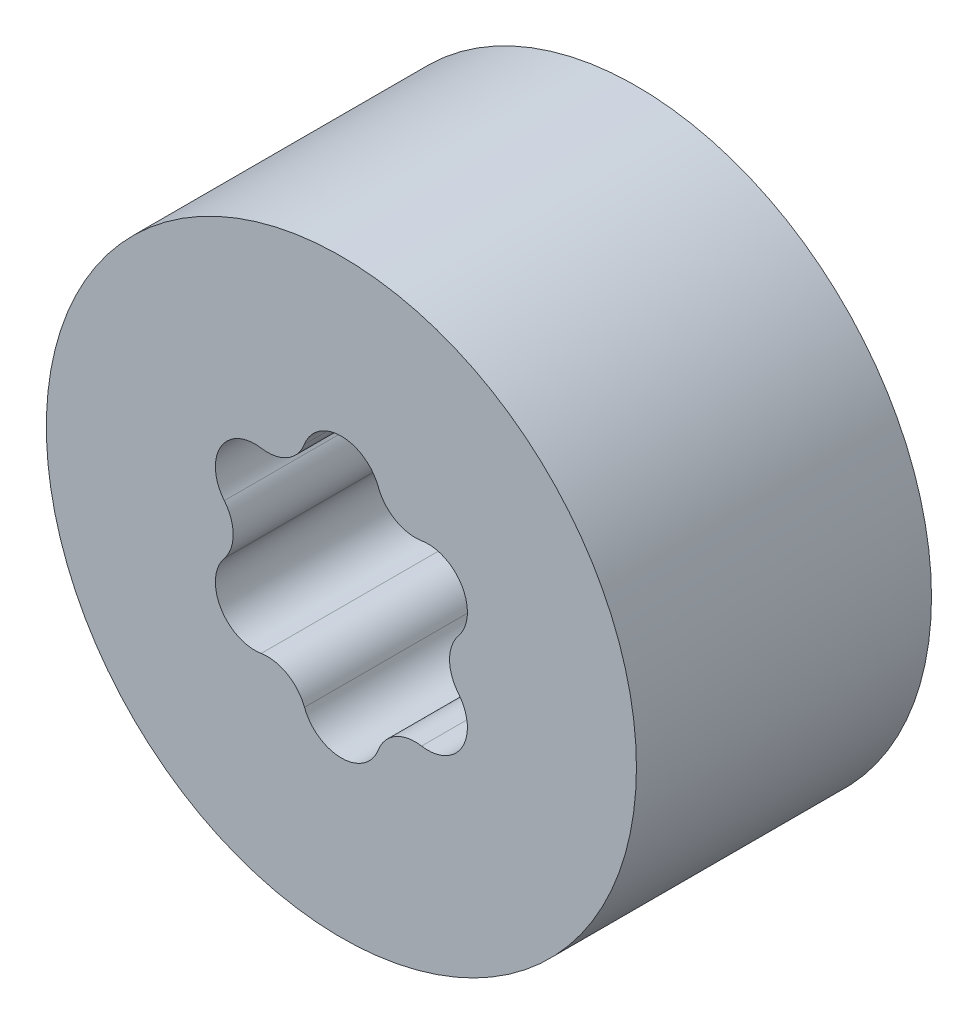
ISO-10303-21;
HEADER;
FILE_DESCRIPTION(('STEP AP214'),'2;1');
FILE_NAME('part.step','',(''),(''),'','','');
FILE_SCHEMA(('AUTOMOTIVE_DESIGN { 1 0 10303 214 1 1 1 1 }'));
ENDSEC;
DATA;
#1=APPLICATION_CONTEXT('core data for automotive mechanical design processes');
#2=APPLICATION_PROTOCOL_DEFINITION('international standard','automotive_design',2000,#1);
#3=PRODUCT_CONTEXT('',#1,'mechanical');
#4=PRODUCT('Part','Part','',(#3));
#5=PRODUCT_RELATED_PRODUCT_CATEGORY('part','',(#4));
#6=PRODUCT_DEFINITION_FORMATION('','',#4);
#7=PRODUCT_DEFINITION_CONTEXT('part definition',#1,'design');
#8=PRODUCT_DEFINITION('design','',#6,#7);
#9=PRODUCT_DEFINITION_SHAPE('','',#8);
#10=(LENGTH_UNIT() NAMED_UNIT(*) SI_UNIT(.MILLI.,.METRE.));
#11=(NAMED_UNIT(*) PLANE_ANGLE_UNIT() SI_UNIT($,.RADIAN.));
#12=(NAMED_UNIT(*) SI_UNIT($,.STERADIAN.) SOLID_ANGLE_UNIT());
#13=UNCERTAINTY_MEASURE_WITH_UNIT(LENGTH_MEASURE(1.E-05),#10,'distance_accuracy_value','');
#14=(GEOMETRIC_REPRESENTATION_CONTEXT(3) GLOBAL_UNCERTAINTY_ASSIGNED_CONTEXT((#13)) GLOBAL_UNIT_ASSIGNED_CONTEXT((#10,
#11,#12)) REPRESENTATION_CONTEXT('',''));
#15=CARTESIAN_POINT('',(0.,0.,0.));
#16=DIRECTION('',(0.,0.,1.));
#17=DIRECTION('',(1.,0.,0.));
#18=AXIS2_PLACEMENT_3D('',#15,#16,#17);
#19=CARTESIAN_POINT('',(0.,0.,9.525));
#20=DIRECTION('',(0.,0.,1.));
#21=DIRECTION('',(1.,0.,0.));
#22=AXIS2_PLACEMENT_3D('',#19,#20,#21);
#23=PLANE('',#22);
#24=CARTESIAN_POINT('',(0.,0.,9.525));
#25=DIRECTION('',(0.,0.,1.));
#26=DIRECTION('',(1.,0.,0.));
#27=AXIS2_PLACEMENT_3D('',#24,#25,#26);
#28=CIRCLE('',#27,19.05);
#29=CARTESIAN_POINT('',(19.05,0.,9.525));
#30=VERTEX_POINT('',#29);
#31=EDGE_CURVE('E11',#30,#30,#28,.T.);
#32=ORIENTED_EDGE('',*,*,#31,.T.);
#33=EDGE_LOOP('',(#32));
#34=FACE_BOUND('',#33,.T.);
#35=CARTESIAN_POINT('',(0.,-6.45235202820206,9.525));
#36=DIRECTION('',(0.,0.,-1.));
#37=DIRECTION('',(-1.,0.,0.));
#38=AXIS2_PLACEMENT_3D('',#35,#36,#37);
#39=CIRCLE('',#38,2.54764797179794);
#40=CARTESIAN_POINT('',(2.38293377059363,-7.35353837584087,9.525));
#41=VERTEX_POINT('',#40);
#42=CARTESIAN_POINT('',(-2.38293377059363,-7.35353837584087,9.525));
#43=VERTEX_POINT('',#42);
#44=EDGE_CURVE('E124',#41,#43,#39,.T.);
#45=ORIENTED_EDGE('',*,*,#44,.T.);
#46=CARTESIAN_POINT('',(-4.76586754118725,-8.25472472347968,9.525));
#47=DIRECTION('',(0.,0.,1.));
#48=DIRECTION('',(-1.,0.,0.));
#49=AXIS2_PLACEMENT_3D('',#46,#47,#48);
#50=CIRCLE('',#49,2.54764797179793);
#51=CARTESIAN_POINT('',(-5.17688415588514,-5.74045036879035,9.525));
#52=VERTEX_POINT('',#51);
#53=EDGE_CURVE('E133',#43,#52,#50,.T.);
#54=ORIENTED_EDGE('',*,*,#53,.T.);
#55=CARTESIAN_POINT('',(-5.58790077058303,-3.22617601410103,9.525));
#56=DIRECTION('',(0.,0.,-1.));
#57=DIRECTION('',(-1.,0.,0.));
#58=AXIS2_PLACEMENT_3D('',#55,#56,#57);
#59=CIRCLE('',#58,2.54764797179794);
#60=CARTESIAN_POINT('',(-7.55981792647877,-1.61308800705051,9.525));
#61=VERTEX_POINT('',#60);
#62=EDGE_CURVE('E48',#52,#61,#59,.T.);
#63=ORIENTED_EDGE('',*,*,#62,.T.);
#64=CARTESIAN_POINT('',(-9.53173508237451,0.,9.525));
#65=DIRECTION('',(0.,0.,1.));
#66=DIRECTION('',(-1.,0.,0.));
#67=AXIS2_PLACEMENT_3D('',#64,#65,#66);
#68=CIRCLE('',#67,2.54764797179794);
#69=CARTESIAN_POINT('',(-7.55981792647877,1.61308800705052,9.525));
#70=VERTEX_POINT('',#69);
#71=EDGE_CURVE('E146',#61,#70,#68,.T.);
#72=ORIENTED_EDGE('',*,*,#71,.T.);
#73=CARTESIAN_POINT('',(-5.58790077058303,3.22617601410103,9.525));
#74=DIRECTION('',(0.,0.,-1.));
#75=DIRECTION('',(-1.,0.,0.));
#76=AXIS2_PLACEMENT_3D('',#73,#74,#75);
#77=CIRCLE('',#76,2.54764797179794);
#78=CARTESIAN_POINT('',(-5.17688415588515,5.74045036879036,9.525));
#79=VERTEX_POINT('',#78);
#80=EDGE_CURVE('E149',#70,#79,#77,.T.);
#81=ORIENTED_EDGE('',*,*,#80,.T.);
#82=CARTESIAN_POINT('',(-4.76586754118726,8.25472472347969,9.525));
#83=DIRECTION('',(0.,0.,1.));
#84=DIRECTION('',(-1.,0.,0.));
#85=AXIS2_PLACEMENT_3D('',#82,#83,#84);
#86=CIRCLE('',#85,2.54764797179794);
#87=CARTESIAN_POINT('',(-2.38293377059363,7.35353837584088,9.525));
#88=VERTEX_POINT('',#87);
#89=EDGE_CURVE('E152',#79,#88,#86,.T.);
#90=ORIENTED_EDGE('',*,*,#89,.T.);
#91=CARTESIAN_POINT('',(0.,6.45235202820207,9.525));
#92=DIRECTION('',(0.,0.,-1.));
#93=DIRECTION('',(-1.,0.,0.));
#94=AXIS2_PLACEMENT_3D('',#91,#92,#93);
#95=CIRCLE('',#94,2.54764797179794);
#96=CARTESIAN_POINT('',(2.38293377059363,7.35353837584088,9.525));
#97=VERTEX_POINT('',#96);
#98=EDGE_CURVE('E155',#88,#97,#95,.T.);
#99=ORIENTED_EDGE('',*,*,#98,.T.);
#100=CARTESIAN_POINT('',(4.76586754118726,8.25472472347969,9.525));
#101=DIRECTION('',(0.,0.,1.));
#102=DIRECTION('',(-1.,0.,0.));
#103=AXIS2_PLACEMENT_3D('',#100,#101,#102);
#104=CIRCLE('',#103,2.54764797179794);
#105=CARTESIAN_POINT('',(5.17688415588514,5.74045036879037,9.525));
#106=VERTEX_POINT('',#105);
#107=EDGE_CURVE('E158',#97,#106,#104,.T.);
#108=ORIENTED_EDGE('',*,*,#107,.T.);
#109=CARTESIAN_POINT('',(5.58790077058303,3.22617601410104,9.525));
#110=DIRECTION('',(0.,0.,-1.));
#111=DIRECTION('',(-1.,0.,0.));
#112=AXIS2_PLACEMENT_3D('',#109,#110,#111);
#113=CIRCLE('',#112,2.54764797179794);
#114=CARTESIAN_POINT('',(7.55981792647877,1.61308800705052,9.525));
#115=VERTEX_POINT('',#114);
#116=EDGE_CURVE('E161',#106,#115,#113,.T.);
#117=ORIENTED_EDGE('',*,*,#116,.T.);
#118=CARTESIAN_POINT('',(9.53173508237451,0.,9.525));
#119=DIRECTION('',(0.,0.,1.));
#120=DIRECTION('',(-1.,0.,0.));
#121=AXIS2_PLACEMENT_3D('',#118,#119,#120);
#122=CIRCLE('',#121,2.54764797179794);
#123=CARTESIAN_POINT('',(7.55981792647877,-1.61308800705051,9.525));
#124=VERTEX_POINT('',#123);
#125=EDGE_CURVE('E164',#115,#124,#122,.T.);
#126=ORIENTED_EDGE('',*,*,#125,.T.);
#127=CARTESIAN_POINT('',(5.58790077058304,-3.22617601410102,9.525));
#128=DIRECTION('',(0.,0.,-1.));
#129=DIRECTION('',(-1.,0.,0.));
#130=AXIS2_PLACEMENT_3D('',#127,#128,#129);
#131=CIRCLE('',#130,2.54764797179793);
#132=CARTESIAN_POINT('',(5.17688415588515,-5.74045036879035,9.525));
#133=VERTEX_POINT('',#132);
#134=EDGE_CURVE('E167',#124,#133,#131,.T.);
#135=ORIENTED_EDGE('',*,*,#134,.T.);
#136=CARTESIAN_POINT('',(4.76586754118726,-8.25472472347968,9.525));
#137=DIRECTION('',(0.,0.,1.));
#138=DIRECTION('',(-1.,0.,0.));
#139=AXIS2_PLACEMENT_3D('',#136,#137,#138);
#140=CIRCLE('',#139,2.54764797179794);
#141=EDGE_CURVE('E130',#133,#41,#140,.T.);
#142=ORIENTED_EDGE('',*,*,#141,.T.);
#143=EDGE_LOOP('',(#45,#54,#63,#72,#81,#90,#99,#108,#117,#126,#135,#142));
#144=FACE_BOUND('',#143,.T.);
#145=ADVANCED_FACE('F33',(#34,#144),#23,.T.);
#146=CARTESIAN_POINT('',(0.,0.,-9.525));
#147=DIRECTION('',(0.,0.,1.));
#148=DIRECTION('',(1.,0.,0.));
#149=AXIS2_PLACEMENT_3D('',#146,#147,#148);
#150=PLANE('',#149);
#151=CARTESIAN_POINT('',(0.,0.,-9.525));
#152=DIRECTION('',(0.,0.,1.));
#153=DIRECTION('',(1.,0.,0.));
#154=AXIS2_PLACEMENT_3D('',#151,#152,#153);
#155=CIRCLE('',#154,19.05);
#156=CARTESIAN_POINT('',(19.05,0.,-9.525));
#157=VERTEX_POINT('',#156);
#158=EDGE_CURVE('E37',#157,#157,#155,.T.);
#159=ORIENTED_EDGE('',*,*,#158,.F.);
#160=EDGE_LOOP('',(#159));
#161=FACE_BOUND('',#160,.T.);
#162=CARTESIAN_POINT('',(-4.76586754118725,-8.25472472347968,-9.525));
#163=DIRECTION('',(0.,0.,1.));
#164=DIRECTION('',(-1.,0.,0.));
#165=AXIS2_PLACEMENT_3D('',#162,#163,#164);
#166=CIRCLE('',#165,2.54764797179793);
#167=CARTESIAN_POINT('',(-2.38293377059363,-7.35353837584087,-9.525));
#168=VERTEX_POINT('',#167);
#169=CARTESIAN_POINT('',(-5.17688415588514,-5.74045036879036,-9.525));
#170=VERTEX_POINT('',#169);
#171=EDGE_CURVE('E171',#168,#170,#166,.T.);
#172=ORIENTED_EDGE('',*,*,#171,.F.);
#173=CARTESIAN_POINT('',(0.,-6.45235202820206,-9.525));
#174=DIRECTION('',(0.,0.,-1.));
#175=DIRECTION('',(-1.,0.,0.));
#176=AXIS2_PLACEMENT_3D('',#173,#174,#175);
#177=CIRCLE('',#176,2.54764797179794);
#178=CARTESIAN_POINT('',(2.38293377059363,-7.35353837584087,-9.525));
#179=VERTEX_POINT('',#178);
#180=EDGE_CURVE('E56',#179,#168,#177,.T.);
#181=ORIENTED_EDGE('',*,*,#180,.F.);
#182=CARTESIAN_POINT('',(4.76586754118726,-8.25472472347968,-9.525));
#183=DIRECTION('',(0.,0.,1.));
#184=DIRECTION('',(-1.,0.,0.));
#185=AXIS2_PLACEMENT_3D('',#182,#183,#184);
#186=CIRCLE('',#185,2.54764797179794);
#187=CARTESIAN_POINT('',(5.17688415588515,-5.74045036879035,-9.525));
#188=VERTEX_POINT('',#187);
#189=EDGE_CURVE('E139',#188,#179,#186,.T.);
#190=ORIENTED_EDGE('',*,*,#189,.F.);
#191=CARTESIAN_POINT('',(5.58790077058304,-3.22617601410102,-9.525));
#192=DIRECTION('',(0.,0.,-1.));
#193=DIRECTION('',(-1.,0.,0.));
#194=AXIS2_PLACEMENT_3D('',#191,#192,#193);
#195=CIRCLE('',#194,2.54764797179793);
#196=CARTESIAN_POINT('',(7.55981792647877,-1.61308800705051,-9.525));
#197=VERTEX_POINT('',#196);
#198=EDGE_CURVE('E142',#197,#188,#195,.T.);
#199=ORIENTED_EDGE('',*,*,#198,.F.);
#200=CARTESIAN_POINT('',(9.53173508237451,0.,-9.525));
#201=DIRECTION('',(0.,0.,1.));
#202=DIRECTION('',(-1.,0.,0.));
#203=AXIS2_PLACEMENT_3D('',#200,#201,#202);
#204=CIRCLE('',#203,2.54764797179794);
#205=CARTESIAN_POINT('',(7.55981792647877,1.61308800705052,-9.525));
#206=VERTEX_POINT('',#205);
#207=EDGE_CURVE('E194',#206,#197,#204,.T.);
#208=ORIENTED_EDGE('',*,*,#207,.F.);
#209=CARTESIAN_POINT('',(5.58790077058303,3.22617601410104,-9.525));
#210=DIRECTION('',(0.,0.,-1.));
#211=DIRECTION('',(-1.,0.,0.));
#212=AXIS2_PLACEMENT_3D('',#209,#210,#211);
#213=CIRCLE('',#212,2.54764797179794);
#214=CARTESIAN_POINT('',(5.17688415588514,5.74045036879037,-9.525));
#215=VERTEX_POINT('',#214);
#216=EDGE_CURVE('E191',#215,#206,#213,.T.);
#217=ORIENTED_EDGE('',*,*,#216,.F.);
#218=CARTESIAN_POINT('',(4.76586754118726,8.25472472347969,-9.525));
#219=DIRECTION('',(0.,0.,1.));
#220=DIRECTION('',(-1.,0.,0.));
#221=AXIS2_PLACEMENT_3D('',#218,#219,#220);
#222=CIRCLE('',#221,2.54764797179794);
#223=CARTESIAN_POINT('',(2.38293377059363,7.35353837584088,-9.525));
#224=VERTEX_POINT('',#223);
#225=EDGE_CURVE('E188',#224,#215,#222,.T.);
#226=ORIENTED_EDGE('',*,*,#225,.F.);
#227=CARTESIAN_POINT('',(0.,6.45235202820207,-9.525));
#228=DIRECTION('',(0.,0.,-1.));
#229=DIRECTION('',(-1.,0.,0.));
#230=AXIS2_PLACEMENT_3D('',#227,#228,#229);
#231=CIRCLE('',#230,2.54764797179794);
#232=CARTESIAN_POINT('',(-2.38293377059363,7.35353837584088,-9.525));
#233=VERTEX_POINT('',#232);
#234=EDGE_CURVE('E185',#233,#224,#231,.T.);
#235=ORIENTED_EDGE('',*,*,#234,.F.);
#236=CARTESIAN_POINT('',(-4.76586754118726,8.25472472347969,-9.525));
#237=DIRECTION('',(0.,0.,1.));
#238=DIRECTION('',(-1.,0.,0.));
#239=AXIS2_PLACEMENT_3D('',#236,#237,#238);
#240=CIRCLE('',#239,2.54764797179794);
#241=CARTESIAN_POINT('',(-5.17688415588515,5.74045036879036,-9.525));
#242=VERTEX_POINT('',#241);
#243=EDGE_CURVE('E182',#242,#233,#240,.T.);
#244=ORIENTED_EDGE('',*,*,#243,.F.);
#245=CARTESIAN_POINT('',(-5.58790077058303,3.22617601410103,-9.525));
#246=DIRECTION('',(0.,0.,-1.));
#247=DIRECTION('',(-1.,0.,0.));
#248=AXIS2_PLACEMENT_3D('',#245,#246,#247);
#249=CIRCLE('',#248,2.54764797179794);
#250=CARTESIAN_POINT('',(-7.55981792647877,1.61308800705052,-9.525));
#251=VERTEX_POINT('',#250);
#252=EDGE_CURVE('E179',#251,#242,#249,.T.);
#253=ORIENTED_EDGE('',*,*,#252,.F.);
#254=CARTESIAN_POINT('',(-9.53173508237451,0.,-9.525));
#255=DIRECTION('',(0.,0.,1.));
#256=DIRECTION('',(-1.,0.,0.));
#257=AXIS2_PLACEMENT_3D('',#254,#255,#256);
#258=CIRCLE('',#257,2.54764797179794);
#259=CARTESIAN_POINT('',(-7.55981792647877,-1.61308800705051,-9.525));
#260=VERTEX_POINT('',#259);
#261=EDGE_CURVE('E176',#260,#251,#258,.T.);
#262=ORIENTED_EDGE('',*,*,#261,.F.);
#263=CARTESIAN_POINT('',(-5.58790077058303,-3.22617601410103,-9.525));
#264=DIRECTION('',(0.,0.,-1.));
#265=DIRECTION('',(-1.,0.,0.));
#266=AXIS2_PLACEMENT_3D('',#263,#264,#265);
#267=CIRCLE('',#266,2.54764797179794);
#268=EDGE_CURVE('E173',#170,#260,#267,.T.);
#269=ORIENTED_EDGE('',*,*,#268,.F.);
#270=EDGE_LOOP('',(#172,#181,#190,#199,#208,#217,#226,#235,#244,#253,#262,#269));
#271=FACE_BOUND('',#270,.T.);
#272=ADVANCED_FACE('F223',(#161,#271),#150,.F.);
#273=CARTESIAN_POINT('',(0.,0.,9.525));
#274=DIRECTION('',(0.,0.,-1.));
#275=DIRECTION('',(-1.,0.,0.));
#276=AXIS2_PLACEMENT_3D('',#273,#274,#275);
#277=CYLINDRICAL_SURFACE('',#276,19.05);
#278=ORIENTED_EDGE('',*,*,#31,.F.);
#279=EDGE_LOOP('',(#278));
#280=FACE_BOUND('',#279,.T.);
#281=ORIENTED_EDGE('',*,*,#158,.T.);
#282=EDGE_LOOP('',(#281));
#283=FACE_BOUND('',#282,.T.);
#284=ADVANCED_FACE('F35',(#280,#283),#277,.T.);
#285=CARTESIAN_POINT('',(0.,-6.45235202820206,9.525));
#286=DIRECTION('',(0.,0.,-1.));
#287=DIRECTION('',(-1.,0.,0.));
#288=AXIS2_PLACEMENT_3D('',#285,#286,#287);
#289=CYLINDRICAL_SURFACE('',#288,2.54764797179794);
#290=ORIENTED_EDGE('',*,*,#180,.T.);
#291=DIRECTION('',(0.,0.,-1.));
#292=VECTOR('',#291,1.);
#293=CARTESIAN_POINT('',(-2.38293377059363,-7.35353837584087,9.525));
#294=LINE('',#293,#292);
#295=EDGE_CURVE('E120',#43,#168,#294,.T.);
#296=ORIENTED_EDGE('',*,*,#295,.F.);
#297=ORIENTED_EDGE('',*,*,#44,.F.);
#298=DIRECTION('',(0.,0.,-1.));
#299=VECTOR('',#298,1.);
#300=CARTESIAN_POINT('',(2.38293377059363,-7.35353837584087,9.525));
#301=LINE('',#300,#299);
#302=EDGE_CURVE('E199',#41,#179,#301,.T.);
#303=ORIENTED_EDGE('',*,*,#302,.T.);
#304=EDGE_LOOP('',(#290,#296,#297,#303));
#305=FACE_BOUND('',#304,.T.);
#306=ADVANCED_FACE('F122',(#305),#289,.F.);
#307=CARTESIAN_POINT('',(4.76586754118726,-8.25472472347968,9.525));
#308=DIRECTION('',(0.,0.,-1.));
#309=DIRECTION('',(-1.,0.,0.));
#310=AXIS2_PLACEMENT_3D('',#307,#308,#309);
#311=CYLINDRICAL_SURFACE('',#310,2.54764797179794);
#312=ORIENTED_EDGE('',*,*,#189,.T.);
#313=ORIENTED_EDGE('',*,*,#302,.F.);
#314=ORIENTED_EDGE('',*,*,#141,.F.);
#315=DIRECTION('',(0.,0.,-1.));
#316=VECTOR('',#315,1.);
#317=CARTESIAN_POINT('',(5.17688415588515,-5.74045036879035,9.525));
#318=LINE('',#317,#316);
#319=EDGE_CURVE('E201',#133,#188,#318,.T.);
#320=ORIENTED_EDGE('',*,*,#319,.T.);
#321=EDGE_LOOP('',(#312,#313,#314,#320));
#322=FACE_BOUND('',#321,.T.);
#323=ADVANCED_FACE('F257',(#322),#311,.T.);
#324=CARTESIAN_POINT('',(5.58790077058304,-3.22617601410102,9.525));
#325=DIRECTION('',(0.,0.,-1.));
#326=DIRECTION('',(-1.,0.,0.));
#327=AXIS2_PLACEMENT_3D('',#324,#325,#326);
#328=CYLINDRICAL_SURFACE('',#327,2.54764797179793);
#329=ORIENTED_EDGE('',*,*,#198,.T.);
#330=ORIENTED_EDGE('',*,*,#319,.F.);
#331=ORIENTED_EDGE('',*,*,#134,.F.);
#332=DIRECTION('',(0.,0.,-1.));
#333=VECTOR('',#332,1.);
#334=CARTESIAN_POINT('',(7.55981792647877,-1.61308800705051,9.525));
#335=LINE('',#334,#333);
#336=EDGE_CURVE('E203',#124,#197,#335,.T.);
#337=ORIENTED_EDGE('',*,*,#336,.T.);
#338=EDGE_LOOP('',(#329,#330,#331,#337));
#339=FACE_BOUND('',#338,.T.);
#340=ADVANCED_FACE('F253',(#339),#328,.F.);
#341=CARTESIAN_POINT('',(9.53173508237451,0.,9.525));
#342=DIRECTION('',(0.,0.,-1.));
#343=DIRECTION('',(-1.,0.,0.));
#344=AXIS2_PLACEMENT_3D('',#341,#342,#343);
#345=CYLINDRICAL_SURFACE('',#344,2.54764797179794);
#346=ORIENTED_EDGE('',*,*,#207,.T.);
#347=ORIENTED_EDGE('',*,*,#336,.F.);
#348=ORIENTED_EDGE('',*,*,#125,.F.);
#349=DIRECTION('',(0.,0.,-1.));
#350=VECTOR('',#349,1.);
#351=CARTESIAN_POINT('',(7.55981792647877,1.61308800705052,9.525));
#352=LINE('',#351,#350);
#353=EDGE_CURVE('E205',#115,#206,#352,.T.);
#354=ORIENTED_EDGE('',*,*,#353,.T.);
#355=EDGE_LOOP('',(#346,#347,#348,#354));
#356=FACE_BOUND('',#355,.T.);
#357=ADVANCED_FACE('F250',(#356),#345,.T.);
#358=CARTESIAN_POINT('',(5.58790077058303,3.22617601410104,9.525));
#359=DIRECTION('',(0.,0.,-1.));
#360=DIRECTION('',(-1.,0.,0.));
#361=AXIS2_PLACEMENT_3D('',#358,#359,#360);
#362=CYLINDRICAL_SURFACE('',#361,2.54764797179794);
#363=ORIENTED_EDGE('',*,*,#216,.T.);
#364=ORIENTED_EDGE('',*,*,#353,.F.);
#365=ORIENTED_EDGE('',*,*,#116,.F.);
#366=DIRECTION('',(0.,0.,-1.));
#367=VECTOR('',#366,1.);
#368=CARTESIAN_POINT('',(5.17688415588514,5.74045036879037,9.525));
#369=LINE('',#368,#367);
#370=EDGE_CURVE('E207',#106,#215,#369,.T.);
#371=ORIENTED_EDGE('',*,*,#370,.T.);
#372=EDGE_LOOP('',(#363,#364,#365,#371));
#373=FACE_BOUND('',#372,.T.);
#374=ADVANCED_FACE('F246',(#373),#362,.F.);
#375=CARTESIAN_POINT('',(4.76586754118726,8.25472472347969,9.525));
#376=DIRECTION('',(0.,0.,-1.));
#377=DIRECTION('',(-1.,0.,0.));
#378=AXIS2_PLACEMENT_3D('',#375,#376,#377);
#379=CYLINDRICAL_SURFACE('',#378,2.54764797179794);
#380=ORIENTED_EDGE('',*,*,#225,.T.);
#381=ORIENTED_EDGE('',*,*,#370,.F.);
#382=ORIENTED_EDGE('',*,*,#107,.F.);
#383=DIRECTION('',(0.,0.,-1.));
#384=VECTOR('',#383,1.);
#385=CARTESIAN_POINT('',(2.38293377059363,7.35353837584088,9.525));
#386=LINE('',#385,#384);
#387=EDGE_CURVE('E209',#97,#224,#386,.T.);
#388=ORIENTED_EDGE('',*,*,#387,.T.);
#389=EDGE_LOOP('',(#380,#381,#382,#388));
#390=FACE_BOUND('',#389,.T.);
#391=ADVANCED_FACE('F242',(#390),#379,.T.);
#392=CARTESIAN_POINT('',(0.,6.45235202820207,9.525));
#393=DIRECTION('',(0.,0.,-1.));
#394=DIRECTION('',(-1.,0.,0.));
#395=AXIS2_PLACEMENT_3D('',#392,#393,#394);
#396=CYLINDRICAL_SURFACE('',#395,2.54764797179794);
#397=ORIENTED_EDGE('',*,*,#234,.T.);
#398=ORIENTED_EDGE('',*,*,#387,.F.);
#399=ORIENTED_EDGE('',*,*,#98,.F.);
#400=DIRECTION('',(0.,0.,-1.));
#401=VECTOR('',#400,1.);
#402=CARTESIAN_POINT('',(-2.38293377059363,7.35353837584088,9.525));
#403=LINE('',#402,#401);
#404=EDGE_CURVE('E211',#88,#233,#403,.T.);
#405=ORIENTED_EDGE('',*,*,#404,.T.);
#406=EDGE_LOOP('',(#397,#398,#399,#405));
#407=FACE_BOUND('',#406,.T.);
#408=ADVANCED_FACE('F238',(#407),#396,.F.);
#409=CARTESIAN_POINT('',(-4.76586754118726,8.25472472347969,9.525));
#410=DIRECTION('',(0.,0.,-1.));
#411=DIRECTION('',(-1.,0.,0.));
#412=AXIS2_PLACEMENT_3D('',#409,#410,#411);
#413=CYLINDRICAL_SURFACE('',#412,2.54764797179794);
#414=ORIENTED_EDGE('',*,*,#243,.T.);
#415=ORIENTED_EDGE('',*,*,#404,.F.);
#416=ORIENTED_EDGE('',*,*,#89,.F.);
#417=DIRECTION('',(0.,0.,-1.));
#418=VECTOR('',#417,1.);
#419=CARTESIAN_POINT('',(-5.17688415588515,5.74045036879036,9.525));
#420=LINE('',#419,#418);
#421=EDGE_CURVE('E213',#79,#242,#420,.T.);
#422=ORIENTED_EDGE('',*,*,#421,.T.);
#423=EDGE_LOOP('',(#414,#415,#416,#422));
#424=FACE_BOUND('',#423,.T.);
#425=ADVANCED_FACE('F234',(#424),#413,.T.);
#426=CARTESIAN_POINT('',(-5.58790077058303,3.22617601410103,9.525));
#427=DIRECTION('',(0.,0.,-1.));
#428=DIRECTION('',(-1.,0.,0.));
#429=AXIS2_PLACEMENT_3D('',#426,#427,#428);
#430=CYLINDRICAL_SURFACE('',#429,2.54764797179794);
#431=ORIENTED_EDGE('',*,*,#252,.T.);
#432=ORIENTED_EDGE('',*,*,#421,.F.);
#433=ORIENTED_EDGE('',*,*,#80,.F.);
#434=DIRECTION('',(0.,0.,-1.));
#435=VECTOR('',#434,1.);
#436=CARTESIAN_POINT('',(-7.55981792647877,1.61308800705052,9.525));
#437=LINE('',#436,#435);
#438=EDGE_CURVE('E215',#70,#251,#437,.T.);
#439=ORIENTED_EDGE('',*,*,#438,.T.);
#440=EDGE_LOOP('',(#431,#432,#433,#439));
#441=FACE_BOUND('',#440,.T.);
#442=ADVANCED_FACE('F232',(#441),#430,.F.);
#443=CARTESIAN_POINT('',(-9.53173508237451,0.,9.525));
#444=DIRECTION('',(0.,0.,-1.));
#445=DIRECTION('',(-1.,0.,0.));
#446=AXIS2_PLACEMENT_3D('',#443,#444,#445);
#447=CYLINDRICAL_SURFACE('',#446,2.54764797179794);
#448=ORIENTED_EDGE('',*,*,#261,.T.);
#449=ORIENTED_EDGE('',*,*,#438,.F.);
#450=ORIENTED_EDGE('',*,*,#71,.F.);
#451=DIRECTION('',(0.,0.,-1.));
#452=VECTOR('',#451,1.);
#453=CARTESIAN_POINT('',(-7.55981792647877,-1.61308800705051,9.525));
#454=LINE('',#453,#452);
#455=EDGE_CURVE('E217',#61,#260,#454,.T.);
#456=ORIENTED_EDGE('',*,*,#455,.T.);
#457=EDGE_LOOP('',(#448,#449,#450,#456));
#458=FACE_BOUND('',#457,.T.);
#459=ADVANCED_FACE('F227',(#458),#447,.T.);
#460=CARTESIAN_POINT('',(-5.58790077058303,-3.22617601410103,9.525));
#461=DIRECTION('',(0.,0.,-1.));
#462=DIRECTION('',(-1.,0.,0.));
#463=AXIS2_PLACEMENT_3D('',#460,#461,#462);
#464=CYLINDRICAL_SURFACE('',#463,2.54764797179794);
#465=ORIENTED_EDGE('',*,*,#268,.T.);
#466=ORIENTED_EDGE('',*,*,#455,.F.);
#467=ORIENTED_EDGE('',*,*,#62,.F.);
#468=DIRECTION('',(0.,0.,-1.));
#469=VECTOR('',#468,1.);
#470=CARTESIAN_POINT('',(-5.17688415588514,-5.74045036879036,9.525));
#471=LINE('',#470,#469);
#472=EDGE_CURVE('E129',#52,#170,#471,.T.);
#473=ORIENTED_EDGE('',*,*,#472,.T.);
#474=EDGE_LOOP('',(#465,#466,#467,#473));
#475=FACE_BOUND('',#474,.T.);
#476=ADVANCED_FACE('F219',(#475),#464,.F.);
#477=CARTESIAN_POINT('',(-4.76586754118725,-8.25472472347968,9.525));
#478=DIRECTION('',(0.,0.,-1.));
#479=DIRECTION('',(-1.,0.,0.));
#480=AXIS2_PLACEMENT_3D('',#477,#478,#479);
#481=CYLINDRICAL_SURFACE('',#480,2.54764797179793);
#482=ORIENTED_EDGE('',*,*,#171,.T.);
#483=ORIENTED_EDGE('',*,*,#472,.F.);
#484=ORIENTED_EDGE('',*,*,#53,.F.);
#485=ORIENTED_EDGE('',*,*,#295,.T.);
#486=EDGE_LOOP('',(#482,#483,#484,#485));
#487=FACE_BOUND('',#486,.T.);
#488=ADVANCED_FACE('F134',(#487),#481,.T.);
#489=CLOSED_SHELL('',(#145,#272,#284,#306,#323,#340,#357,#374,#391,#408,#425,#442,#459,#476,#488));
#490=MANIFOLD_SOLID_BREP('B2',#489);
#491=ADVANCED_BREP_SHAPE_REPRESENTATION('',(#18,#490),#14);
#492=SHAPE_DEFINITION_REPRESENTATION(#9,#491);
ENDSEC;
END-ISO-10303-21;
